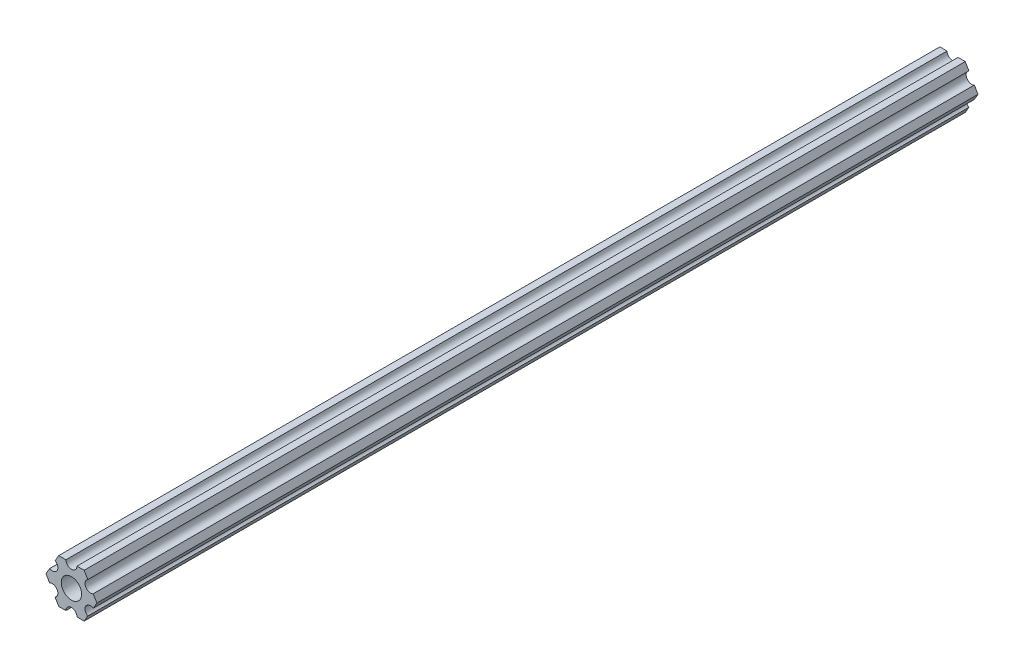
ISO-10303-21;
HEADER;
FILE_DESCRIPTION(('STEP AP214'),'2;1');
FILE_NAME('part.step','',(''),(''),'','','');
FILE_SCHEMA(('AUTOMOTIVE_DESIGN { 1 0 10303 214 1 1 1 1 }'));
ENDSEC;
DATA;
#1=APPLICATION_CONTEXT('core data for automotive mechanical design processes');
#2=APPLICATION_PROTOCOL_DEFINITION('international standard','automotive_design',2000,#1);
#3=PRODUCT_CONTEXT('',#1,'mechanical');
#4=PRODUCT('Part','Part','',(#3));
#5=PRODUCT_RELATED_PRODUCT_CATEGORY('part','',(#4));
#6=PRODUCT_DEFINITION_FORMATION('','',#4);
#7=PRODUCT_DEFINITION_CONTEXT('part definition',#1,'design');
#8=PRODUCT_DEFINITION('design','',#6,#7);
#9=PRODUCT_DEFINITION_SHAPE('','',#8);
#10=(LENGTH_UNIT() NAMED_UNIT(*) SI_UNIT(.MILLI.,.METRE.));
#11=(NAMED_UNIT(*) PLANE_ANGLE_UNIT() SI_UNIT($,.RADIAN.));
#12=(NAMED_UNIT(*) SI_UNIT($,.STERADIAN.) SOLID_ANGLE_UNIT());
#13=UNCERTAINTY_MEASURE_WITH_UNIT(LENGTH_MEASURE(1.E-05),#10,'distance_accuracy_value','');
#14=(GEOMETRIC_REPRESENTATION_CONTEXT(3) GLOBAL_UNCERTAINTY_ASSIGNED_CONTEXT((#13)) GLOBAL_UNIT_ASSIGNED_CONTEXT((#10,
#11,#12)) REPRESENTATION_CONTEXT('',''));
#15=CARTESIAN_POINT('',(0.,0.,0.));
#16=DIRECTION('',(0.,0.,1.));
#17=DIRECTION('',(1.,0.,0.));
#18=AXIS2_PLACEMENT_3D('',#15,#16,#17);
#19=CARTESIAN_POINT('',(-5.49926150638083,-3.17499966684068,-254.));
#20=DIRECTION('',(0.,0.,1.));
#21=DIRECTION('',(1.,0.,0.));
#22=AXIS2_PLACEMENT_3D('',#19,#20,#21);
#23=CYLINDRICAL_SURFACE('',#22,1.58750000000001);
#24=CARTESIAN_POINT('',(-5.49926150638083,-3.17499966684068,0.));
#25=DIRECTION('',(0.,0.,-1.));
#26=DIRECTION('',(-1.,0.,0.));
#27=AXIS2_PLACEMENT_3D('',#24,#25,#26);
#28=CIRCLE('',#27,1.58750000000001);
#29=CARTESIAN_POINT('',(-6.29301142309098,-1.80018429024546,0.));
#30=VERTEX_POINT('',#29);
#31=CARTESIAN_POINT('',(-4.70551158967068,-4.54981504343589,0.));
#32=VERTEX_POINT('',#31);
#33=EDGE_CURVE('E189',#30,#32,#28,.T.);
#34=ORIENTED_EDGE('',*,*,#33,.F.);
#35=DIRECTION('',(0.,0.,1.));
#36=VECTOR('',#35,1.);
#37=CARTESIAN_POINT('',(-6.29301142309098,-1.80018429024546,-254.));
#38=LINE('',#37,#36);
#39=CARTESIAN_POINT('',(-6.29301142309098,-1.80018429024546,-254.));
#40=VERTEX_POINT('',#39);
#41=EDGE_CURVE('E11',#40,#30,#38,.T.);
#42=ORIENTED_EDGE('',*,*,#41,.F.);
#43=CARTESIAN_POINT('',(-5.49926150638083,-3.17499966684068,-254.));
#44=DIRECTION('',(0.,0.,-1.));
#45=DIRECTION('',(-1.,0.,0.));
#46=AXIS2_PLACEMENT_3D('',#43,#44,#45);
#47=CIRCLE('',#46,1.58750000000001);
#48=CARTESIAN_POINT('',(-4.70551158967068,-4.54981504343589,-254.));
#49=VERTEX_POINT('',#48);
#50=EDGE_CURVE('E240',#40,#49,#47,.T.);
#51=ORIENTED_EDGE('',*,*,#50,.T.);
#52=DIRECTION('',(0.,0.,1.));
#53=VECTOR('',#52,1.);
#54=CARTESIAN_POINT('',(-4.70551158967068,-4.54981504343589,-254.));
#55=LINE('',#54,#53);
#56=EDGE_CURVE('E35',#49,#32,#55,.T.);
#57=ORIENTED_EDGE('',*,*,#56,.T.);
#58=EDGE_LOOP('',(#34,#42,#51,#57));
#59=FACE_BOUND('',#58,.T.);
#60=ADVANCED_FACE('F32',(#59),#23,.F.);
#61=CARTESIAN_POINT('',(-7.33234841870826,4.44212518856872E-07,-254.));
#62=DIRECTION('',(-0.866025434075723,-0.499999947533953,0.));
#63=DIRECTION('',(0.499999947533953,-0.866025434075723,0.));
#64=AXIS2_PLACEMENT_3D('',#61,#62,#63);
#65=PLANE('',#64);
#66=DIRECTION('',(0.499999947533953,-0.866025434075723,0.));
#67=VECTOR('',#66,1.);
#68=CARTESIAN_POINT('',(-7.33234841870826,4.44212518856872E-07,0.));
#69=LINE('',#68,#67);
#70=CARTESIAN_POINT('',(-7.33234841870826,4.44212518856872E-07,0.));
#71=VERTEX_POINT('',#70);
#72=EDGE_CURVE('E238',#71,#30,#69,.T.);
#73=ORIENTED_EDGE('',*,*,#72,.F.);
#74=DIRECTION('',(0.,0.,1.));
#75=VECTOR('',#74,1.);
#76=CARTESIAN_POINT('',(-7.33234841870826,4.44212518856872E-07,-254.));
#77=LINE('',#76,#75);
#78=CARTESIAN_POINT('',(-7.33234841870826,4.44212518856872E-07,-254.));
#79=VERTEX_POINT('',#78);
#80=EDGE_CURVE('E41',#79,#71,#77,.T.);
#81=ORIENTED_EDGE('',*,*,#80,.F.);
#82=DIRECTION('',(0.499999947533953,-0.866025434075723,0.));
#83=VECTOR('',#82,1.);
#84=CARTESIAN_POINT('',(-7.33234841870826,4.44212518856872E-07,-254.));
#85=LINE('',#84,#83);
#86=EDGE_CURVE('E179',#79,#40,#85,.T.);
#87=ORIENTED_EDGE('',*,*,#86,.T.);
#88=ORIENTED_EDGE('',*,*,#41,.T.);
#89=EDGE_LOOP('',(#73,#81,#87,#88));
#90=FACE_BOUND('',#89,.T.);
#91=ADVANCED_FACE('F272',(#90),#65,.T.);
#92=CARTESIAN_POINT('',(-6.29301120497139,1.80018505273895,-254.));
#93=DIRECTION('',(-0.866025373493145,0.500000052466056,0.));
#94=DIRECTION('',(-0.500000052466056,-0.866025373493145,0.));
#95=AXIS2_PLACEMENT_3D('',#92,#93,#94);
#96=PLANE('',#95);
#97=DIRECTION('',(-0.500000052466056,-0.866025373493145,0.));
#98=VECTOR('',#97,1.);
#99=CARTESIAN_POINT('',(-6.29301120497139,1.80018505273895,0.));
#100=LINE('',#99,#98);
#101=CARTESIAN_POINT('',(-6.29301120497139,1.80018505273895,0.));
#102=VERTEX_POINT('',#101);
#103=EDGE_CURVE('E166',#102,#71,#100,.T.);
#104=ORIENTED_EDGE('',*,*,#103,.F.);
#105=DIRECTION('',(0.,0.,1.));
#106=VECTOR('',#105,1.);
#107=CARTESIAN_POINT('',(-6.29301120497139,1.80018505273895,-254.));
#108=LINE('',#107,#106);
#109=CARTESIAN_POINT('',(-6.29301120497139,1.80018505273895,-254.));
#110=VERTEX_POINT('',#109);
#111=EDGE_CURVE('E161',#110,#102,#108,.T.);
#112=ORIENTED_EDGE('',*,*,#111,.F.);
#113=DIRECTION('',(-0.500000052466056,-0.866025373493145,0.));
#114=VECTOR('',#113,1.);
#115=CARTESIAN_POINT('',(-6.29301120497139,1.80018505273895,-254.));
#116=LINE('',#115,#114);
#117=EDGE_CURVE('E164',#110,#79,#116,.T.);
#118=ORIENTED_EDGE('',*,*,#117,.T.);
#119=ORIENTED_EDGE('',*,*,#80,.T.);
#120=EDGE_LOOP('',(#104,#112,#118,#119));
#121=FACE_BOUND('',#120,.T.);
#122=ADVANCED_FACE('F163',(#121),#96,.T.);
#123=CARTESIAN_POINT('',(-5.49926112168152,3.17500033315931,-254.));
#124=DIRECTION('',(0.,0.,1.));
#125=DIRECTION('',(1.,0.,0.));
#126=AXIS2_PLACEMENT_3D('',#123,#124,#125);
#127=CYLINDRICAL_SURFACE('',#126,1.5875);
#128=CARTESIAN_POINT('',(-5.49926112168152,3.17500033315931,0.));
#129=DIRECTION('',(0.,0.,-1.));
#130=DIRECTION('',(-1.,0.,0.));
#131=AXIS2_PLACEMENT_3D('',#128,#129,#130);
#132=CIRCLE('',#131,1.5875);
#133=CARTESIAN_POINT('',(-4.70551103839166,4.54981561357968,0.));
#134=VERTEX_POINT('',#133);
#135=EDGE_CURVE('E235',#134,#102,#132,.T.);
#136=ORIENTED_EDGE('',*,*,#135,.F.);
#137=DIRECTION('',(0.,0.,1.));
#138=VECTOR('',#137,1.);
#139=CARTESIAN_POINT('',(-4.70551103839166,4.54981561357968,-254.));
#140=LINE('',#139,#138);
#141=CARTESIAN_POINT('',(-4.70551103839166,4.54981561357968,-254.));
#142=VERTEX_POINT('',#141);
#143=EDGE_CURVE('E171',#142,#134,#140,.T.);
#144=ORIENTED_EDGE('',*,*,#143,.F.);
#145=CARTESIAN_POINT('',(-5.49926112168152,3.17500033315931,-254.));
#146=DIRECTION('',(0.,0.,-1.));
#147=DIRECTION('',(-1.,0.,0.));
#148=AXIS2_PLACEMENT_3D('',#145,#146,#147);
#149=CIRCLE('',#148,1.5875);
#150=EDGE_CURVE('E177',#142,#110,#149,.T.);
#151=ORIENTED_EDGE('',*,*,#150,.T.);
#152=ORIENTED_EDGE('',*,*,#111,.T.);
#153=EDGE_LOOP('',(#136,#144,#151,#152));
#154=FACE_BOUND('',#153,.T.);
#155=ADVANCED_FACE('F181',(#154),#127,.F.);
#156=CARTESIAN_POINT('',(-3.66617382465472,6.35000022210622,-254.));
#157=DIRECTION('',(-0.866025373493145,0.500000052466056,0.));
#158=DIRECTION('',(-0.500000052466056,-0.866025373493145,0.));
#159=AXIS2_PLACEMENT_3D('',#156,#157,#158);
#160=PLANE('',#159);
#161=DIRECTION('',(-0.500000052466056,-0.866025373493145,0.));
#162=VECTOR('',#161,1.);
#163=CARTESIAN_POINT('',(-3.66617382465472,6.35000022210622,0.));
#164=LINE('',#163,#162);
#165=CARTESIAN_POINT('',(-3.66617382465472,6.35000022210622,0.));
#166=VERTEX_POINT('',#165);
#167=EDGE_CURVE('E232',#166,#134,#164,.T.);
#168=ORIENTED_EDGE('',*,*,#167,.F.);
#169=DIRECTION('',(0.,0.,1.));
#170=VECTOR('',#169,1.);
#171=CARTESIAN_POINT('',(-3.66617382465472,6.35000022210622,-254.));
#172=LINE('',#171,#170);
#173=CARTESIAN_POINT('',(-3.66617382465472,6.35000022210622,-254.));
#174=VERTEX_POINT('',#173);
#175=EDGE_CURVE('E244',#174,#166,#172,.T.);
#176=ORIENTED_EDGE('',*,*,#175,.F.);
#177=DIRECTION('',(-0.500000052466056,-0.866025373493145,0.));
#178=VECTOR('',#177,1.);
#179=CARTESIAN_POINT('',(-3.66617382465472,6.35000022210622,-254.));
#180=LINE('',#179,#178);
#181=EDGE_CURVE('E182',#174,#142,#180,.T.);
#182=ORIENTED_EDGE('',*,*,#181,.T.);
#183=ORIENTED_EDGE('',*,*,#143,.T.);
#184=EDGE_LOOP('',(#168,#176,#182,#183));
#185=FACE_BOUND('',#184,.T.);
#186=ADVANCED_FACE('F285',(#185),#160,.T.);
#187=CARTESIAN_POINT('',(-1.58749884590197,6.35000022210623,-254.));
#188=DIRECTION('',(0.,1.,0.));
#189=DIRECTION('',(-1.,0.,0.));
#190=AXIS2_PLACEMENT_3D('',#187,#188,#189);
#191=PLANE('',#190);
#192=DIRECTION('',(-1.,0.,0.));
#193=VECTOR('',#192,1.);
#194=CARTESIAN_POINT('',(-1.58749884590197,6.35000022210623,0.));
#195=LINE('',#194,#193);
#196=CARTESIAN_POINT('',(-1.58749884590197,6.35000022210623,0.));
#197=VERTEX_POINT('',#196);
#198=EDGE_CURVE('E229',#197,#166,#195,.T.);
#199=ORIENTED_EDGE('',*,*,#198,.F.);
#200=DIRECTION('',(0.,0.,1.));
#201=VECTOR('',#200,1.);
#202=CARTESIAN_POINT('',(-1.58749884590197,6.35000022210623,-254.));
#203=LINE('',#202,#201);
#204=CARTESIAN_POINT('',(-1.58749884590197,6.35000022210623,-254.));
#205=VERTEX_POINT('',#204);
#206=EDGE_CURVE('E246',#205,#197,#203,.T.);
#207=ORIENTED_EDGE('',*,*,#206,.F.);
#208=DIRECTION('',(-1.,0.,0.));
#209=VECTOR('',#208,1.);
#210=CARTESIAN_POINT('',(-1.58749884590197,6.35000022210623,-254.));
#211=LINE('',#210,#209);
#212=EDGE_CURVE('E184',#205,#174,#211,.T.);
#213=ORIENTED_EDGE('',*,*,#212,.T.);
#214=ORIENTED_EDGE('',*,*,#175,.T.);
#215=EDGE_LOOP('',(#199,#207,#213,#214));
#216=FACE_BOUND('',#215,.T.);
#217=ADVANCED_FACE('F288',(#216),#191,.T.);
#218=CARTESIAN_POINT('',(3.84699344941095E-07,6.35000022210623,-254.));
#219=DIRECTION('',(0.,0.,1.));
#220=DIRECTION('',(1.,0.,0.));
#221=AXIS2_PLACEMENT_3D('',#218,#219,#220);
#222=CYLINDRICAL_SURFACE('',#221,1.58749884590197);
#223=CARTESIAN_POINT('',(3.84699344941095E-07,6.35000022210623,0.));
#224=DIRECTION('',(0.,0.,-1.));
#225=DIRECTION('',(-1.,0.,0.));
#226=AXIS2_PLACEMENT_3D('',#223,#224,#225);
#227=CIRCLE('',#226,1.58749884590197);
#228=CARTESIAN_POINT('',(1.58749923060131,6.35000022210623,0.));
#229=VERTEX_POINT('',#228);
#230=EDGE_CURVE('E226',#229,#197,#227,.T.);
#231=ORIENTED_EDGE('',*,*,#230,.F.);
#232=DIRECTION('',(0.,0.,1.));
#233=VECTOR('',#232,1.);
#234=CARTESIAN_POINT('',(1.58749923060131,6.35000022210623,-254.));
#235=LINE('',#234,#233);
#236=CARTESIAN_POINT('',(1.58749923060131,6.35000022210623,-254.));
#237=VERTEX_POINT('',#236);
#238=EDGE_CURVE('E248',#237,#229,#235,.T.);
#239=ORIENTED_EDGE('',*,*,#238,.F.);
#240=CARTESIAN_POINT('',(3.84699344941095E-07,6.35000022210623,-254.));
#241=DIRECTION('',(0.,0.,-1.));
#242=DIRECTION('',(-1.,0.,0.));
#243=AXIS2_PLACEMENT_3D('',#240,#241,#242);
#244=CIRCLE('',#243,1.58749884590197);
#245=EDGE_CURVE('E393',#237,#205,#244,.T.);
#246=ORIENTED_EDGE('',*,*,#245,.T.);
#247=ORIENTED_EDGE('',*,*,#206,.T.);
#248=EDGE_LOOP('',(#231,#239,#246,#247));
#249=FACE_BOUND('',#248,.T.);
#250=ADVANCED_FACE('F292',(#249),#222,.F.);
#251=CARTESIAN_POINT('',(3.66617452134701,6.35000022210623,-254.));
#252=DIRECTION('',(0.,1.,0.));
#253=DIRECTION('',(-1.,0.,0.));
#254=AXIS2_PLACEMENT_3D('',#251,#252,#253);
#255=PLANE('',#254);
#256=DIRECTION('',(-1.,0.,0.));
#257=VECTOR('',#256,1.);
#258=CARTESIAN_POINT('',(3.66617452134701,6.35000022210623,0.));
#259=LINE('',#258,#257);
#260=CARTESIAN_POINT('',(3.66617452134701,6.35000022210623,0.));
#261=VERTEX_POINT('',#260);
#262=EDGE_CURVE('E223',#261,#229,#259,.T.);
#263=ORIENTED_EDGE('',*,*,#262,.F.);
#264=DIRECTION('',(0.,0.,1.));
#265=VECTOR('',#264,1.);
#266=CARTESIAN_POINT('',(3.66617452134701,6.35000022210623,-254.));
#267=LINE('',#266,#265);
#268=CARTESIAN_POINT('',(3.66617452134701,6.35000022210623,-254.));
#269=VERTEX_POINT('',#268);
#270=EDGE_CURVE('E250',#269,#261,#267,.T.);
#271=ORIENTED_EDGE('',*,*,#270,.F.);
#272=DIRECTION('',(-1.,0.,0.));
#273=VECTOR('',#272,1.);
#274=CARTESIAN_POINT('',(3.66617452134701,6.35000022210623,-254.));
#275=LINE('',#274,#273);
#276=EDGE_CURVE('E390',#269,#237,#275,.T.);
#277=ORIENTED_EDGE('',*,*,#276,.T.);
#278=ORIENTED_EDGE('',*,*,#238,.T.);
#279=EDGE_LOOP('',(#263,#271,#277,#278));
#280=FACE_BOUND('',#279,.T.);
#281=ADVANCED_FACE('F296',(#280),#255,.T.);
#282=CARTESIAN_POINT('',(4.70551142760333,4.54981551649452,-254.));
#283=DIRECTION('',(0.866025449221368,0.499999921300922,0.));
#284=DIRECTION('',(-0.499999921300922,0.866025449221368,0.));
#285=AXIS2_PLACEMENT_3D('',#282,#283,#284);
#286=PLANE('',#285);
#287=DIRECTION('',(-0.499999921300922,0.866025449221368,0.));
#288=VECTOR('',#287,1.);
#289=CARTESIAN_POINT('',(4.70551142760333,4.54981551649452,0.));
#290=LINE('',#289,#288);
#291=CARTESIAN_POINT('',(4.70551142760333,4.54981551649452,0.));
#292=VERTEX_POINT('',#291);
#293=EDGE_CURVE('E220',#292,#261,#290,.T.);
#294=ORIENTED_EDGE('',*,*,#293,.F.);
#295=DIRECTION('',(0.,0.,1.));
#296=VECTOR('',#295,1.);
#297=CARTESIAN_POINT('',(4.70551142760333,4.54981551649452,-254.));
#298=LINE('',#297,#296);
#299=CARTESIAN_POINT('',(4.70551142760333,4.54981551649452,-254.));
#300=VERTEX_POINT('',#299);
#301=EDGE_CURVE('E252',#300,#292,#298,.T.);
#302=ORIENTED_EDGE('',*,*,#301,.F.);
#303=DIRECTION('',(-0.499999921300922,0.866025449221368,0.));
#304=VECTOR('',#303,1.);
#305=CARTESIAN_POINT('',(4.70551142760333,4.54981551649452,-254.));
#306=LINE('',#305,#304);
#307=EDGE_CURVE('E387',#300,#269,#306,.T.);
#308=ORIENTED_EDGE('',*,*,#307,.T.);
#309=ORIENTED_EDGE('',*,*,#270,.T.);
#310=EDGE_LOOP('',(#294,#302,#308,#309));
#311=FACE_BOUND('',#310,.T.);
#312=ADVANCED_FACE('F300',(#311),#286,.T.);
#313=CARTESIAN_POINT('',(5.49926130266854,3.1750001158556,-254.));
#314=DIRECTION('',(0.,0.,1.));
#315=DIRECTION('',(1.,0.,0.));
#316=AXIS2_PLACEMENT_3D('',#313,#314,#315);
#317=CYLINDRICAL_SURFACE('',#316,1.5875);
#318=CARTESIAN_POINT('',(5.49926130266854,3.1750001158556,0.));
#319=DIRECTION('',(0.,0.,-1.));
#320=DIRECTION('',(-1.,0.,0.));
#321=AXIS2_PLACEMENT_3D('',#318,#319,#320);
#322=CIRCLE('',#321,1.5875);
#323=CARTESIAN_POINT('',(6.29301117773375,1.80018471521667,0.));
#324=VERTEX_POINT('',#323);
#325=EDGE_CURVE('E217',#324,#292,#322,.T.);
#326=ORIENTED_EDGE('',*,*,#325,.F.);
#327=DIRECTION('',(0.,0.,1.));
#328=VECTOR('',#327,1.);
#329=CARTESIAN_POINT('',(6.29301117773375,1.80018471521667,-254.));
#330=LINE('',#329,#328);
#331=CARTESIAN_POINT('',(6.29301117773375,1.80018471521667,-254.));
#332=VERTEX_POINT('',#331);
#333=EDGE_CURVE('E254',#332,#324,#330,.T.);
#334=ORIENTED_EDGE('',*,*,#333,.F.);
#335=CARTESIAN_POINT('',(5.49926130266854,3.1750001158556,-254.));
#336=DIRECTION('',(0.,0.,-1.));
#337=DIRECTION('',(-1.,0.,0.));
#338=AXIS2_PLACEMENT_3D('',#335,#336,#337);
#339=CIRCLE('',#338,1.5875);
#340=EDGE_CURVE('E384',#332,#300,#339,.T.);
#341=ORIENTED_EDGE('',*,*,#340,.T.);
#342=ORIENTED_EDGE('',*,*,#301,.T.);
#343=EDGE_LOOP('',(#326,#334,#341,#342));
#344=FACE_BOUND('',#343,.T.);
#345=ADVANCED_FACE('F304',(#344),#317,.F.);
#346=CARTESIAN_POINT('',(7.33234803400895,9.61748368946088E-08,-254.));
#347=DIRECTION('',(0.866025449221368,0.499999921300922,0.));
#348=DIRECTION('',(-0.499999921300922,0.866025449221368,0.));
#349=AXIS2_PLACEMENT_3D('',#346,#347,#348);
#350=PLANE('',#349);
#351=DIRECTION('',(-0.499999921300922,0.866025449221368,0.));
#352=VECTOR('',#351,1.);
#353=CARTESIAN_POINT('',(7.33234803400895,9.61748368946088E-08,0.));
#354=LINE('',#353,#352);
#355=CARTESIAN_POINT('',(7.33234803400895,9.61748368946088E-08,0.));
#356=VERTEX_POINT('',#355);
#357=EDGE_CURVE('E214',#356,#324,#354,.T.);
#358=ORIENTED_EDGE('',*,*,#357,.F.);
#359=DIRECTION('',(0.,0.,1.));
#360=VECTOR('',#359,1.);
#361=CARTESIAN_POINT('',(7.33234803400895,9.61748368946088E-08,-254.));
#362=LINE('',#361,#360);
#363=CARTESIAN_POINT('',(7.33234803400895,9.61748368946088E-08,-254.));
#364=VERTEX_POINT('',#363);
#365=EDGE_CURVE('E256',#364,#356,#362,.T.);
#366=ORIENTED_EDGE('',*,*,#365,.F.);
#367=DIRECTION('',(-0.499999921300922,0.866025449221368,0.));
#368=VECTOR('',#367,1.);
#369=CARTESIAN_POINT('',(7.33234803400895,9.61748368946088E-08,-254.));
#370=LINE('',#369,#368);
#371=EDGE_CURVE('E381',#364,#332,#370,.T.);
#372=ORIENTED_EDGE('',*,*,#371,.T.);
#373=ORIENTED_EDGE('',*,*,#333,.T.);
#374=EDGE_LOOP('',(#358,#366,#372,#373));
#375=FACE_BOUND('',#374,.T.);
#376=ADVANCED_FACE('F308',(#375),#350,.T.);
#377=CARTESIAN_POINT('',(6.29301092933191,-1.80018457531732,-254.));
#378=DIRECTION('',(0.866025403784438,-0.5,0.));
#379=DIRECTION('',(0.5,0.866025403784438,0.));
#380=AXIS2_PLACEMENT_3D('',#377,#378,#379);
#381=PLANE('',#380);
#382=DIRECTION('',(0.5,0.866025403784438,0.));
#383=VECTOR('',#382,1.);
#384=CARTESIAN_POINT('',(6.29301092933191,-1.80018457531732,0.));
#385=LINE('',#384,#383);
#386=CARTESIAN_POINT('',(6.29301092933191,-1.80018457531732,0.));
#387=VERTEX_POINT('',#386);
#388=EDGE_CURVE('E211',#387,#356,#385,.T.);
#389=ORIENTED_EDGE('',*,*,#388,.F.);
#390=DIRECTION('',(0.,0.,1.));
#391=VECTOR('',#390,1.);
#392=CARTESIAN_POINT('',(6.29301092933191,-1.80018457531732,-254.));
#393=LINE('',#392,#391);
#394=CARTESIAN_POINT('',(6.29301092933191,-1.80018457531732,-254.));
#395=VERTEX_POINT('',#394);
#396=EDGE_CURVE('E258',#395,#387,#393,.T.);
#397=ORIENTED_EDGE('',*,*,#396,.F.);
#398=DIRECTION('',(0.5,0.866025403784438,0.));
#399=VECTOR('',#398,1.);
#400=CARTESIAN_POINT('',(6.29301092933191,-1.80018457531732,-254.));
#401=LINE('',#400,#399);
#402=EDGE_CURVE('E378',#395,#364,#401,.T.);
#403=ORIENTED_EDGE('',*,*,#402,.T.);
#404=ORIENTED_EDGE('',*,*,#365,.T.);
#405=EDGE_LOOP('',(#389,#397,#403,#404));
#406=FACE_BOUND('',#405,.T.);
#407=ADVANCED_FACE('F312',(#406),#381,.T.);
#408=CARTESIAN_POINT('',(5.49926092933191,-3.17499990382512,-254.));
#409=DIRECTION('',(0.,0.,1.));
#410=DIRECTION('',(1.,0.,0.));
#411=AXIS2_PLACEMENT_3D('',#408,#409,#410);
#412=CYLINDRICAL_SURFACE('',#411,1.5875);
#413=CARTESIAN_POINT('',(5.49926092933191,-3.17499990382512,0.));
#414=DIRECTION('',(0.,0.,-1.));
#415=DIRECTION('',(-1.,0.,0.));
#416=AXIS2_PLACEMENT_3D('',#413,#414,#415);
#417=CIRCLE('',#416,1.5875);
#418=CARTESIAN_POINT('',(4.70551092933191,-4.54981523233291,0.));
#419=VERTEX_POINT('',#418);
#420=EDGE_CURVE('E208',#419,#387,#417,.T.);
#421=ORIENTED_EDGE('',*,*,#420,.F.);
#422=DIRECTION('',(0.,0.,1.));
#423=VECTOR('',#422,1.);
#424=CARTESIAN_POINT('',(4.70551092933191,-4.54981523233291,-254.));
#425=LINE('',#424,#423);
#426=CARTESIAN_POINT('',(4.70551092933191,-4.54981523233291,-254.));
#427=VERTEX_POINT('',#426);
#428=EDGE_CURVE('E260',#427,#419,#425,.T.);
#429=ORIENTED_EDGE('',*,*,#428,.F.);
#430=CARTESIAN_POINT('',(5.49926092933191,-3.17499990382512,-254.));
#431=DIRECTION('',(0.,0.,-1.));
#432=DIRECTION('',(-1.,0.,0.));
#433=AXIS2_PLACEMENT_3D('',#430,#431,#432);
#434=CIRCLE('',#433,1.5875);
#435=EDGE_CURVE('E375',#427,#395,#434,.T.);
#436=ORIENTED_EDGE('',*,*,#435,.T.);
#437=ORIENTED_EDGE('',*,*,#396,.T.);
#438=EDGE_LOOP('',(#421,#429,#436,#437));
#439=FACE_BOUND('',#438,.T.);
#440=ADVANCED_FACE('F316',(#439),#412,.F.);
#441=CARTESIAN_POINT('',(3.66617382465481,-6.34999990382519,-254.));
#442=DIRECTION('',(0.866025403784438,-0.5,0.));
#443=DIRECTION('',(0.5,0.866025403784439,0.));
#444=AXIS2_PLACEMENT_3D('',#441,#442,#443);
#445=PLANE('',#444);
#446=DIRECTION('',(0.5,0.866025403784439,0.));
#447=VECTOR('',#446,1.);
#448=CARTESIAN_POINT('',(3.66617382465481,-6.34999990382519,0.));
#449=LINE('',#448,#447);
#450=CARTESIAN_POINT('',(3.66617382465481,-6.34999990382519,0.));
#451=VERTEX_POINT('',#450);
#452=EDGE_CURVE('E205',#451,#419,#449,.T.);
#453=ORIENTED_EDGE('',*,*,#452,.F.);
#454=DIRECTION('',(0.,0.,1.));
#455=VECTOR('',#454,1.);
#456=CARTESIAN_POINT('',(3.66617382465481,-6.34999990382519,-254.));
#457=LINE('',#456,#455);
#458=CARTESIAN_POINT('',(3.66617382465481,-6.34999990382519,-254.));
#459=VERTEX_POINT('',#458);
#460=EDGE_CURVE('E262',#459,#451,#457,.T.);
#461=ORIENTED_EDGE('',*,*,#460,.F.);
#462=DIRECTION('',(0.5,0.866025403784439,0.));
#463=VECTOR('',#462,1.);
#464=CARTESIAN_POINT('',(3.66617382465481,-6.34999990382519,-254.));
#465=LINE('',#464,#463);
#466=EDGE_CURVE('E372',#459,#427,#465,.T.);
#467=ORIENTED_EDGE('',*,*,#466,.T.);
#468=ORIENTED_EDGE('',*,*,#428,.T.);
#469=EDGE_LOOP('',(#453,#461,#467,#468));
#470=FACE_BOUND('',#469,.T.);
#471=ADVANCED_FACE('F320',(#470),#445,.T.);
#472=CARTESIAN_POINT('',(1.58750115409778,-6.34999990382519,-254.));
#473=DIRECTION('',(0.,-1.,0.));
#474=DIRECTION('',(1.,0.,0.));
#475=AXIS2_PLACEMENT_3D('',#472,#473,#474);
#476=PLANE('',#475);
#477=DIRECTION('',(1.,0.,0.));
#478=VECTOR('',#477,1.);
#479=CARTESIAN_POINT('',(1.58750115409778,-6.34999990382519,0.));
#480=LINE('',#479,#478);
#481=CARTESIAN_POINT('',(1.58750115409778,-6.34999990382519,0.));
#482=VERTEX_POINT('',#481);
#483=EDGE_CURVE('E202',#482,#451,#480,.T.);
#484=ORIENTED_EDGE('',*,*,#483,.F.);
#485=DIRECTION('',(0.,0.,1.));
#486=VECTOR('',#485,1.);
#487=CARTESIAN_POINT('',(1.58750115409778,-6.34999990382519,-254.));
#488=LINE('',#487,#486);
#489=CARTESIAN_POINT('',(1.58750115409778,-6.34999990382519,-254.));
#490=VERTEX_POINT('',#489);
#491=EDGE_CURVE('E264',#490,#482,#488,.T.);
#492=ORIENTED_EDGE('',*,*,#491,.F.);
#493=DIRECTION('',(1.,0.,0.));
#494=VECTOR('',#493,1.);
#495=CARTESIAN_POINT('',(1.58750115409778,-6.34999990382519,-254.));
#496=LINE('',#495,#494);
#497=EDGE_CURVE('E369',#490,#459,#496,.T.);
#498=ORIENTED_EDGE('',*,*,#497,.T.);
#499=ORIENTED_EDGE('',*,*,#460,.T.);
#500=EDGE_LOOP('',(#484,#492,#498,#499));
#501=FACE_BOUND('',#500,.T.);
#502=ADVANCED_FACE('F324',(#501),#476,.T.);
#503=CARTESIAN_POINT('',(-3.8469926204343E-07,-6.34999990382519,-254.));
#504=DIRECTION('',(0.,0.,1.));
#505=DIRECTION('',(1.,0.,0.));
#506=AXIS2_PLACEMENT_3D('',#503,#504,#505);
#507=CYLINDRICAL_SURFACE('',#506,1.58750115409778);
#508=CARTESIAN_POINT('',(-3.8469926204343E-07,-6.34999990382519,0.));
#509=DIRECTION('',(0.,0.,-1.));
#510=DIRECTION('',(-1.,0.,0.));
#511=AXIS2_PLACEMENT_3D('',#508,#509,#510);
#512=CIRCLE('',#511,1.58750115409778);
#513=CARTESIAN_POINT('',(-1.58750153879705,-6.34999990382519,0.));
#514=VERTEX_POINT('',#513);
#515=EDGE_CURVE('E199',#514,#482,#512,.T.);
#516=ORIENTED_EDGE('',*,*,#515,.F.);
#517=DIRECTION('',(0.,0.,1.));
#518=VECTOR('',#517,1.);
#519=CARTESIAN_POINT('',(-1.58750153879705,-6.34999990382519,-254.));
#520=LINE('',#519,#518);
#521=CARTESIAN_POINT('',(-1.58750153879705,-6.34999990382519,-254.));
#522=VERTEX_POINT('',#521);
#523=EDGE_CURVE('E266',#522,#514,#520,.T.);
#524=ORIENTED_EDGE('',*,*,#523,.F.);
#525=CARTESIAN_POINT('',(-3.8469926204343E-07,-6.34999990382519,-254.));
#526=DIRECTION('',(0.,0.,-1.));
#527=DIRECTION('',(-1.,0.,0.));
#528=AXIS2_PLACEMENT_3D('',#525,#526,#527);
#529=CIRCLE('',#528,1.58750115409778);
#530=EDGE_CURVE('E366',#522,#490,#529,.T.);
#531=ORIENTED_EDGE('',*,*,#530,.T.);
#532=ORIENTED_EDGE('',*,*,#491,.T.);
#533=EDGE_LOOP('',(#516,#524,#531,#532));
#534=FACE_BOUND('',#533,.T.);
#535=ADVANCED_FACE('F328',(#534),#507,.F.);
#536=CARTESIAN_POINT('',(-3.66617452134693,-6.34999990382519,-254.));
#537=DIRECTION('',(0.,-1.,0.));
#538=DIRECTION('',(1.,0.,0.));
#539=AXIS2_PLACEMENT_3D('',#536,#537,#538);
#540=PLANE('',#539);
#541=DIRECTION('',(1.,0.,0.));
#542=VECTOR('',#541,1.);
#543=CARTESIAN_POINT('',(-3.66617452134693,-6.34999990382519,0.));
#544=LINE('',#543,#542);
#545=CARTESIAN_POINT('',(-3.66617452134693,-6.34999990382519,0.));
#546=VERTEX_POINT('',#545);
#547=EDGE_CURVE('E196',#546,#514,#544,.T.);
#548=ORIENTED_EDGE('',*,*,#547,.F.);
#549=DIRECTION('',(0.,0.,1.));
#550=VECTOR('',#549,1.);
#551=CARTESIAN_POINT('',(-3.66617452134693,-6.34999990382519,-254.));
#552=LINE('',#551,#550);
#553=CARTESIAN_POINT('',(-3.66617452134693,-6.34999990382519,-254.));
#554=VERTEX_POINT('',#553);
#555=EDGE_CURVE('E267',#554,#546,#552,.T.);
#556=ORIENTED_EDGE('',*,*,#555,.F.);
#557=DIRECTION('',(1.,0.,0.));
#558=VECTOR('',#557,1.);
#559=CARTESIAN_POINT('',(-3.66617452134693,-6.34999990382519,-254.));
#560=LINE('',#559,#558);
#561=EDGE_CURVE('E363',#554,#522,#560,.T.);
#562=ORIENTED_EDGE('',*,*,#561,.T.);
#563=ORIENTED_EDGE('',*,*,#523,.T.);
#564=EDGE_LOOP('',(#548,#556,#562,#563));
#565=FACE_BOUND('',#564,.T.);
#566=ADVANCED_FACE('F332',(#565),#540,.T.);
#567=CARTESIAN_POINT('',(-4.70551158967068,-4.54981504343589,-254.));
#568=DIRECTION('',(-0.866025434075723,-0.499999947533953,0.));
#569=DIRECTION('',(0.499999947533953,-0.866025434075723,0.));
#570=AXIS2_PLACEMENT_3D('',#567,#568,#569);
#571=PLANE('',#570);
#572=DIRECTION('',(0.499999947533953,-0.866025434075723,0.));
#573=VECTOR('',#572,1.);
#574=CARTESIAN_POINT('',(-4.70551158967068,-4.54981504343589,0.));
#575=LINE('',#574,#573);
#576=EDGE_CURVE('E192',#32,#546,#575,.T.);
#577=ORIENTED_EDGE('',*,*,#576,.F.);
#578=ORIENTED_EDGE('',*,*,#56,.F.);
#579=DIRECTION('',(0.499999947533953,-0.866025434075723,0.));
#580=VECTOR('',#579,1.);
#581=CARTESIAN_POINT('',(-4.70551158967068,-4.54981504343589,-254.));
#582=LINE('',#581,#580);
#583=EDGE_CURVE('E361',#49,#554,#582,.T.);
#584=ORIENTED_EDGE('',*,*,#583,.T.);
#585=ORIENTED_EDGE('',*,*,#555,.T.);
#586=EDGE_LOOP('',(#577,#578,#584,#585));
#587=FACE_BOUND('',#586,.T.);
#588=ADVANCED_FACE('F269',(#587),#571,.T.);
#589=CARTESIAN_POINT('',(-5.49926150638083,-3.17499966684068,-254.));
#590=DIRECTION('',(0.,0.,-1.));
#591=DIRECTION('',(-1.,0.,0.));
#592=AXIS2_PLACEMENT_3D('',#589,#590,#591);
#593=PLANE('',#592);
#594=CARTESIAN_POINT('',(0.,0.,-254.));
#595=DIRECTION('',(0.,0.,1.));
#596=DIRECTION('',(-1.,0.,0.));
#597=AXIS2_PLACEMENT_3D('',#594,#595,#596);
#598=CIRCLE('',#597,2.9337);
#599=CARTESIAN_POINT('',(-2.9337,0.,-254.));
#600=VERTEX_POINT('',#599);
#601=EDGE_CURVE('E193',#600,#600,#598,.T.);
#602=ORIENTED_EDGE('',*,*,#601,.T.);
#603=EDGE_LOOP('',(#602));
#604=FACE_BOUND('',#603,.T.);
#605=ORIENTED_EDGE('',*,*,#50,.F.);
#606=ORIENTED_EDGE('',*,*,#86,.F.);
#607=ORIENTED_EDGE('',*,*,#117,.F.);
#608=ORIENTED_EDGE('',*,*,#150,.F.);
#609=ORIENTED_EDGE('',*,*,#181,.F.);
#610=ORIENTED_EDGE('',*,*,#212,.F.);
#611=ORIENTED_EDGE('',*,*,#245,.F.);
#612=ORIENTED_EDGE('',*,*,#276,.F.);
#613=ORIENTED_EDGE('',*,*,#307,.F.);
#614=ORIENTED_EDGE('',*,*,#340,.F.);
#615=ORIENTED_EDGE('',*,*,#371,.F.);
#616=ORIENTED_EDGE('',*,*,#402,.F.);
#617=ORIENTED_EDGE('',*,*,#435,.F.);
#618=ORIENTED_EDGE('',*,*,#466,.F.);
#619=ORIENTED_EDGE('',*,*,#497,.F.);
#620=ORIENTED_EDGE('',*,*,#530,.F.);
#621=ORIENTED_EDGE('',*,*,#561,.F.);
#622=ORIENTED_EDGE('',*,*,#583,.F.);
#623=EDGE_LOOP('',(#605,#606,#607,#608,#609,#610,#611,#612,#613,#614,#615,#616,#617,#618,#619,
#620,#621,#622));
#624=FACE_BOUND('',#623,.T.);
#625=ADVANCED_FACE('F175',(#604,#624),#593,.T.);
#626=CARTESIAN_POINT('',(-5.49926150638083,-3.17499966684068,0.));
#627=DIRECTION('',(0.,0.,-1.));
#628=DIRECTION('',(-1.,0.,0.));
#629=AXIS2_PLACEMENT_3D('',#626,#627,#628);
#630=PLANE('',#629);
#631=CARTESIAN_POINT('',(0.,0.,0.));
#632=DIRECTION('',(0.,0.,1.));
#633=DIRECTION('',(-1.,0.,0.));
#634=AXIS2_PLACEMENT_3D('',#631,#632,#633);
#635=CIRCLE('',#634,2.9337);
#636=CARTESIAN_POINT('',(-2.9337,0.,0.));
#637=VERTEX_POINT('',#636);
#638=EDGE_CURVE('E356',#637,#637,#635,.T.);
#639=ORIENTED_EDGE('',*,*,#638,.F.);
#640=EDGE_LOOP('',(#639));
#641=FACE_BOUND('',#640,.T.);
#642=ORIENTED_EDGE('',*,*,#33,.T.);
#643=ORIENTED_EDGE('',*,*,#576,.T.);
#644=ORIENTED_EDGE('',*,*,#547,.T.);
#645=ORIENTED_EDGE('',*,*,#515,.T.);
#646=ORIENTED_EDGE('',*,*,#483,.T.);
#647=ORIENTED_EDGE('',*,*,#452,.T.);
#648=ORIENTED_EDGE('',*,*,#420,.T.);
#649=ORIENTED_EDGE('',*,*,#388,.T.);
#650=ORIENTED_EDGE('',*,*,#357,.T.);
#651=ORIENTED_EDGE('',*,*,#325,.T.);
#652=ORIENTED_EDGE('',*,*,#293,.T.);
#653=ORIENTED_EDGE('',*,*,#262,.T.);
#654=ORIENTED_EDGE('',*,*,#230,.T.);
#655=ORIENTED_EDGE('',*,*,#198,.T.);
#656=ORIENTED_EDGE('',*,*,#167,.T.);
#657=ORIENTED_EDGE('',*,*,#135,.T.);
#658=ORIENTED_EDGE('',*,*,#103,.T.);
#659=ORIENTED_EDGE('',*,*,#72,.T.);
#660=EDGE_LOOP('',(#642,#643,#644,#645,#646,#647,#648,#649,#650,#651,#652,#653,#654,#655,#656,
#657,#658,#659));
#661=FACE_BOUND('',#660,.T.);
#662=ADVANCED_FACE('F271',(#641,#661),#630,.F.);
#663=CARTESIAN_POINT('',(0.,0.,-254.));
#664=DIRECTION('',(0.,0.,1.));
#665=DIRECTION('',(1.,0.,0.));
#666=AXIS2_PLACEMENT_3D('',#663,#664,#665);
#667=CYLINDRICAL_SURFACE('',#666,2.9337);
#668=ORIENTED_EDGE('',*,*,#601,.F.);
#669=EDGE_LOOP('',(#668));
#670=FACE_BOUND('',#669,.T.);
#671=ORIENTED_EDGE('',*,*,#638,.T.);
#672=EDGE_LOOP('',(#671));
#673=FACE_BOUND('',#672,.T.);
#674=ADVANCED_FACE('F344',(#670,#673),#667,.F.);
#675=CLOSED_SHELL('',(#60,#91,#122,#155,#186,#217,#250,#281,#312,#345,#376,#407,#440,#471,#502,
#535,#566,#588,#625,#662,#674));
#676=MANIFOLD_SOLID_BREP('B2',#675);
#677=ADVANCED_BREP_SHAPE_REPRESENTATION('',(#18,#676),#14);
#678=SHAPE_DEFINITION_REPRESENTATION(#9,#677);
ENDSEC;
END-ISO-10303-21;
